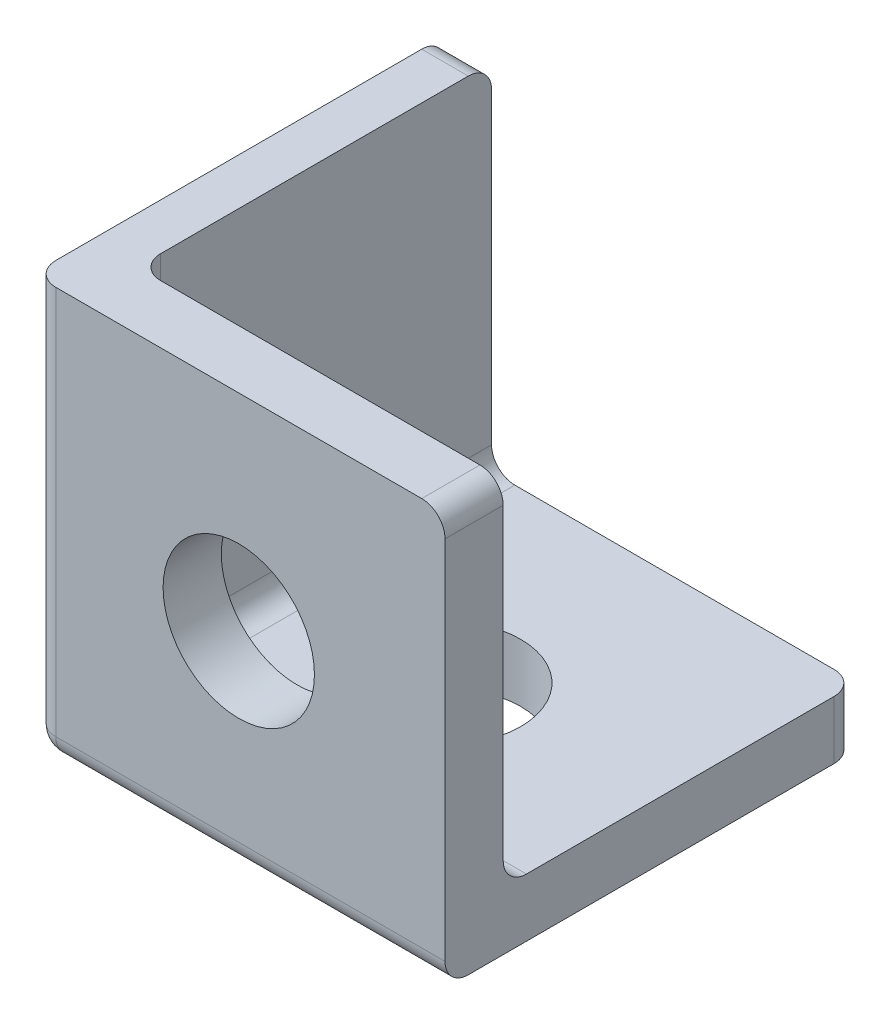
ISO-10303-21;
HEADER;
FILE_DESCRIPTION(('STEP AP214'),'2;1');
FILE_NAME('part.step','',(''),(''),'','','');
FILE_SCHEMA(('AUTOMOTIVE_DESIGN { 1 0 10303 214 1 1 1 1 }'));
ENDSEC;
DATA;
#1=APPLICATION_CONTEXT('core data for automotive mechanical design processes');
#2=APPLICATION_PROTOCOL_DEFINITION('international standard','automotive_design',2000,#1);
#3=PRODUCT_CONTEXT('',#1,'mechanical');
#4=PRODUCT('Part','Part','',(#3));
#5=PRODUCT_RELATED_PRODUCT_CATEGORY('part','',(#4));
#6=PRODUCT_DEFINITION_FORMATION('','',#4);
#7=PRODUCT_DEFINITION_CONTEXT('part definition',#1,'design');
#8=PRODUCT_DEFINITION('design','',#6,#7);
#9=PRODUCT_DEFINITION_SHAPE('','',#8);
#10=(LENGTH_UNIT() NAMED_UNIT(*) SI_UNIT(.MILLI.,.METRE.));
#11=(NAMED_UNIT(*) PLANE_ANGLE_UNIT() SI_UNIT($,.RADIAN.));
#12=(NAMED_UNIT(*) SI_UNIT($,.STERADIAN.) SOLID_ANGLE_UNIT());
#13=UNCERTAINTY_MEASURE_WITH_UNIT(LENGTH_MEASURE(1.E-05),#10,'distance_accuracy_value','');
#14=(GEOMETRIC_REPRESENTATION_CONTEXT(3) GLOBAL_UNCERTAINTY_ASSIGNED_CONTEXT((#13)) GLOBAL_UNIT_ASSIGNED_CONTEXT((#10,
#11,#12)) REPRESENTATION_CONTEXT('',''));
#15=CARTESIAN_POINT('',(0.,0.,0.));
#16=DIRECTION('',(0.,0.,1.));
#17=DIRECTION('',(1.,0.,0.));
#18=AXIS2_PLACEMENT_3D('',#15,#16,#17);
#19=CARTESIAN_POINT('',(45.,6.34999999999999,0.));
#20=DIRECTION('',(0.,-1.,0.));
#21=DIRECTION('',(0.,0.,-1.));
#22=AXIS2_PLACEMENT_3D('',#19,#20,#21);
#23=PLANE('',#22);
#24=CARTESIAN_POINT('',(22.5,6.35,-22.499999958));
#25=DIRECTION('',(0.,1.,0.));
#26=DIRECTION('',(0.,0.,1.));
#27=AXIS2_PLACEMENT_3D('',#24,#25,#26);
#28=CIRCLE('',#27,8.255);
#29=CARTESIAN_POINT('',(22.5,6.35,-14.244999958));
#30=VERTEX_POINT('',#29);
#31=EDGE_CURVE('E179',#30,#30,#28,.T.);
#32=ORIENTED_EDGE('',*,*,#31,.F.);
#33=EDGE_LOOP('',(#32));
#34=FACE_BOUND('',#33,.T.);
#35=DIRECTION('',(0.,0.,1.));
#36=VECTOR('',#35,1.);
#37=CARTESIAN_POINT('',(45.,6.34999999999999,0.));
#38=LINE('',#37,#36);
#39=CARTESIAN_POINT('',(45.,6.35,-42.459999916));
#40=VERTEX_POINT('',#39);
#41=CARTESIAN_POINT('',(45.,6.35,-8.89));
#42=VERTEX_POINT('',#41);
#43=EDGE_CURVE('E176',#40,#42,#38,.T.);
#44=ORIENTED_EDGE('',*,*,#43,.F.);
#45=CARTESIAN_POINT('',(42.46,6.35,-42.459999916));
#46=DIRECTION('',(0.,-1.,0.));
#47=DIRECTION('',(0.,0.,-1.));
#48=AXIS2_PLACEMENT_3D('',#45,#46,#47);
#49=CIRCLE('',#48,2.54);
#50=CARTESIAN_POINT('',(42.46,6.35,-44.999999916));
#51=VERTEX_POINT('',#50);
#52=EDGE_CURVE('E229',#40,#51,#49,.F.);
#53=ORIENTED_EDGE('',*,*,#52,.T.);
#54=DIRECTION('',(-1.,0.,0.));
#55=VECTOR('',#54,1.);
#56=CARTESIAN_POINT('',(45.,6.35,-44.999999916));
#57=LINE('',#56,#55);
#58=CARTESIAN_POINT('',(7.62000000000002,6.35,-44.999999916));
#59=VERTEX_POINT('',#58);
#60=EDGE_CURVE('E185',#51,#59,#57,.T.);
#61=ORIENTED_EDGE('',*,*,#60,.T.);
#62=DIRECTION('',(0.,0.,1.));
#63=VECTOR('',#62,1.);
#64=CARTESIAN_POINT('',(7.62,6.34999999999999,0.));
#65=LINE('',#64,#63);
#66=CARTESIAN_POINT('',(7.62,6.35,-8.89));
#67=VERTEX_POINT('',#66);
#68=EDGE_CURVE('E225',#59,#67,#65,.T.);
#69=ORIENTED_EDGE('',*,*,#68,.T.);
#70=DIRECTION('',(-1.,0.,0.));
#71=VECTOR('',#70,1.);
#72=CARTESIAN_POINT('',(45.,6.35,-8.89));
#73=LINE('',#72,#71);
#74=EDGE_CURVE('E227',#67,#42,#73,.F.);
#75=ORIENTED_EDGE('',*,*,#74,.T.);
#76=EDGE_LOOP('',(#44,#53,#61,#69,#75));
#77=FACE_BOUND('',#76,.T.);
#78=ADVANCED_FACE('F35',(#34,#77),#23,.F.);
#79=CARTESIAN_POINT('',(45.,0.,-6.35));
#80=DIRECTION('',(0.,0.,1.));
#81=DIRECTION('',(0.,-1.,0.));
#82=AXIS2_PLACEMENT_3D('',#79,#80,#81);
#83=PLANE('',#82);
#84=CARTESIAN_POINT('',(22.5,22.499999958,-6.35));
#85=DIRECTION('',(0.,0.,-1.));
#86=DIRECTION('',(0.,1.,0.));
#87=AXIS2_PLACEMENT_3D('',#84,#85,#86);
#88=CIRCLE('',#87,8.255);
#89=CARTESIAN_POINT('',(22.5,30.754999958,-6.35));
#90=VERTEX_POINT('',#89);
#91=EDGE_CURVE('E254',#90,#90,#88,.T.);
#92=ORIENTED_EDGE('',*,*,#91,.F.);
#93=EDGE_LOOP('',(#92));
#94=FACE_BOUND('',#93,.T.);
#95=DIRECTION('',(-1.,0.,0.));
#96=VECTOR('',#95,1.);
#97=CARTESIAN_POINT('',(45.,44.999999916,-6.35));
#98=LINE('',#97,#96);
#99=CARTESIAN_POINT('',(42.46,44.999999916,-6.35));
#100=VERTEX_POINT('',#99);
#101=CARTESIAN_POINT('',(7.62000000000002,44.999999916,-6.35));
#102=VERTEX_POINT('',#101);
#103=EDGE_CURVE('E193',#100,#102,#98,.T.);
#104=ORIENTED_EDGE('',*,*,#103,.F.);
#105=CARTESIAN_POINT('',(42.46,42.459999916,-6.35));
#106=DIRECTION('',(0.,0.,1.));
#107=DIRECTION('',(0.,-1.,0.));
#108=AXIS2_PLACEMENT_3D('',#105,#106,#107);
#109=CIRCLE('',#108,2.54);
#110=CARTESIAN_POINT('',(45.,42.459999916,-6.35));
#111=VERTEX_POINT('',#110);
#112=EDGE_CURVE('E236',#100,#111,#109,.F.);
#113=ORIENTED_EDGE('',*,*,#112,.T.);
#114=DIRECTION('',(0.,1.,0.));
#115=VECTOR('',#114,1.);
#116=CARTESIAN_POINT('',(45.,0.,-6.35));
#117=LINE('',#116,#115);
#118=CARTESIAN_POINT('',(45.,8.89,-6.35));
#119=VERTEX_POINT('',#118);
#120=EDGE_CURVE('E270',#119,#111,#117,.T.);
#121=ORIENTED_EDGE('',*,*,#120,.F.);
#122=DIRECTION('',(-1.,0.,0.));
#123=VECTOR('',#122,1.);
#124=CARTESIAN_POINT('',(5.08000000000002,8.89,-6.35));
#125=LINE('',#124,#123);
#126=CARTESIAN_POINT('',(7.62,8.89,-6.35));
#127=VERTEX_POINT('',#126);
#128=EDGE_CURVE('E233',#119,#127,#125,.T.);
#129=ORIENTED_EDGE('',*,*,#128,.T.);
#130=DIRECTION('',(0.,1.,0.));
#131=VECTOR('',#130,1.);
#132=CARTESIAN_POINT('',(7.62,0.,-6.35));
#133=LINE('',#132,#131);
#134=EDGE_CURVE('E231',#127,#102,#133,.T.);
#135=ORIENTED_EDGE('',*,*,#134,.T.);
#136=EDGE_LOOP('',(#104,#113,#121,#129,#135));
#137=FACE_BOUND('',#136,.T.);
#138=ADVANCED_FACE('F268',(#94,#137),#83,.F.);
#139=CARTESIAN_POINT('',(45.,44.999999916,0.));
#140=DIRECTION('',(0.,1.,0.));
#141=DIRECTION('',(0.,0.,1.));
#142=AXIS2_PLACEMENT_3D('',#139,#140,#141);
#143=PLANE('',#142);
#144=DIRECTION('',(0.,0.,-1.));
#145=VECTOR('',#144,1.);
#146=CARTESIAN_POINT('',(0.,44.999999916,0.));
#147=LINE('',#146,#145);
#148=CARTESIAN_POINT('',(0.,44.999999916,-2.54));
#149=VERTEX_POINT('',#148);
#150=CARTESIAN_POINT('',(0.,44.999999916,-42.459999916));
#151=VERTEX_POINT('',#150);
#152=EDGE_CURVE('E162',#149,#151,#147,.T.);
#153=ORIENTED_EDGE('',*,*,#152,.F.);
#154=CARTESIAN_POINT('',(2.54,44.999999916,-2.54));
#155=DIRECTION('',(0.,1.,0.));
#156=DIRECTION('',(0.,0.,1.));
#157=AXIS2_PLACEMENT_3D('',#154,#155,#156);
#158=CIRCLE('',#157,2.54);
#159=CARTESIAN_POINT('',(2.54000000000001,44.999999916,0.));
#160=VERTEX_POINT('',#159);
#161=EDGE_CURVE('E146',#149,#160,#158,.T.);
#162=ORIENTED_EDGE('',*,*,#161,.T.);
#163=DIRECTION('',(-1.,0.,0.));
#164=VECTOR('',#163,1.);
#165=CARTESIAN_POINT('',(45.,44.999999916,0.));
#166=LINE('',#165,#164);
#167=CARTESIAN_POINT('',(42.46,44.999999916,0.));
#168=VERTEX_POINT('',#167);
#169=EDGE_CURVE('E191',#168,#160,#166,.T.);
#170=ORIENTED_EDGE('',*,*,#169,.F.);
#171=DIRECTION('',(0.,0.,-1.));
#172=VECTOR('',#171,1.);
#173=CARTESIAN_POINT('',(42.46,44.999999916,0.));
#174=LINE('',#173,#172);
#175=EDGE_CURVE('E157',#168,#100,#174,.T.);
#176=ORIENTED_EDGE('',*,*,#175,.T.);
#177=ORIENTED_EDGE('',*,*,#103,.T.);
#178=CARTESIAN_POINT('',(7.62,44.999999916,-8.89));
#179=DIRECTION('',(0.,1.,0.));
#180=DIRECTION('',(0.,0.,1.));
#181=AXIS2_PLACEMENT_3D('',#178,#179,#180);
#182=CIRCLE('',#181,2.54);
#183=CARTESIAN_POINT('',(5.08,44.999999916,-8.89));
#184=VERTEX_POINT('',#183);
#185=EDGE_CURVE('E11',#102,#184,#182,.F.);
#186=ORIENTED_EDGE('',*,*,#185,.T.);
#187=DIRECTION('',(0.,0.,1.));
#188=VECTOR('',#187,1.);
#189=CARTESIAN_POINT('',(5.08,44.999999916,0.));
#190=LINE('',#189,#188);
#191=CARTESIAN_POINT('',(5.08,44.999999916,-42.459999916));
#192=VERTEX_POINT('',#191);
#193=EDGE_CURVE('E324',#192,#184,#190,.T.);
#194=ORIENTED_EDGE('',*,*,#193,.F.);
#195=DIRECTION('',(-1.,0.,0.));
#196=VECTOR('',#195,1.);
#197=CARTESIAN_POINT('',(45.,44.999999916,-42.459999916));
#198=LINE('',#197,#196);
#199=EDGE_CURVE('E167',#192,#151,#198,.T.);
#200=ORIENTED_EDGE('',*,*,#199,.T.);
#201=EDGE_LOOP('',(#153,#162,#170,#176,#177,#186,#194,#200));
#202=FACE_BOUND('',#201,.T.);
#203=ADVANCED_FACE('F170',(#202),#143,.T.);
#204=CARTESIAN_POINT('',(45.,0.,0.));
#205=DIRECTION('',(0.,0.,1.));
#206=DIRECTION('',(1.,0.,0.));
#207=AXIS2_PLACEMENT_3D('',#204,#205,#206);
#208=PLANE('',#207);
#209=CARTESIAN_POINT('',(22.5,22.499999958,0.));
#210=DIRECTION('',(0.,0.,-1.));
#211=DIRECTION('',(0.,1.,0.));
#212=AXIS2_PLACEMENT_3D('',#209,#210,#211);
#213=CIRCLE('',#212,8.255);
#214=CARTESIAN_POINT('',(22.5,30.754999958,0.));
#215=VERTEX_POINT('',#214);
#216=EDGE_CURVE('E325',#215,#215,#213,.T.);
#217=ORIENTED_EDGE('',*,*,#216,.T.);
#218=EDGE_LOOP('',(#217));
#219=FACE_BOUND('',#218,.T.);
#220=ORIENTED_EDGE('',*,*,#169,.T.);
#221=DIRECTION('',(0.,1.,0.));
#222=VECTOR('',#221,1.);
#223=CARTESIAN_POINT('',(2.54,0.,0.));
#224=LINE('',#223,#222);
#225=CARTESIAN_POINT('',(2.54,2.54,0.));
#226=VERTEX_POINT('',#225);
#227=EDGE_CURVE('E151',#160,#226,#224,.F.);
#228=ORIENTED_EDGE('',*,*,#227,.T.);
#229=DIRECTION('',(-1.,0.,0.));
#230=VECTOR('',#229,1.);
#231=CARTESIAN_POINT('',(45.,2.54,0.));
#232=LINE('',#231,#230);
#233=CARTESIAN_POINT('',(45.,2.54,0.));
#234=VERTEX_POINT('',#233);
#235=EDGE_CURVE('E203',#226,#234,#232,.F.);
#236=ORIENTED_EDGE('',*,*,#235,.T.);
#237=DIRECTION('',(0.,1.,0.));
#238=VECTOR('',#237,1.);
#239=CARTESIAN_POINT('',(45.,0.,0.));
#240=LINE('',#239,#238);
#241=CARTESIAN_POINT('',(45.,42.459999916,0.));
#242=VERTEX_POINT('',#241);
#243=EDGE_CURVE('E284',#234,#242,#240,.T.);
#244=ORIENTED_EDGE('',*,*,#243,.T.);
#245=CARTESIAN_POINT('',(42.46,42.459999916,0.));
#246=DIRECTION('',(0.,0.,1.));
#247=DIRECTION('',(1.,0.,0.));
#248=AXIS2_PLACEMENT_3D('',#245,#246,#247);
#249=CIRCLE('',#248,2.54);
#250=EDGE_CURVE('E156',#242,#168,#249,.T.);
#251=ORIENTED_EDGE('',*,*,#250,.T.);
#252=EDGE_LOOP('',(#220,#228,#236,#244,#251));
#253=FACE_BOUND('',#252,.T.);
#254=ADVANCED_FACE('F342',(#219,#253),#208,.T.);
#255=CARTESIAN_POINT('',(45.,0.,0.));
#256=DIRECTION('',(0.,-1.,0.));
#257=DIRECTION('',(0.,0.,-1.));
#258=AXIS2_PLACEMENT_3D('',#255,#256,#257);
#259=PLANE('',#258);
#260=CARTESIAN_POINT('',(22.5,0.,-22.499999958));
#261=DIRECTION('',(0.,1.,0.));
#262=DIRECTION('',(0.,0.,1.));
#263=AXIS2_PLACEMENT_3D('',#260,#261,#262);
#264=CIRCLE('',#263,8.255);
#265=CARTESIAN_POINT('',(22.5,0.,-14.244999958));
#266=VERTEX_POINT('',#265);
#267=EDGE_CURVE('E174',#266,#266,#264,.T.);
#268=ORIENTED_EDGE('',*,*,#267,.T.);
#269=EDGE_LOOP('',(#268));
#270=FACE_BOUND('',#269,.T.);
#271=DIRECTION('',(0.,0.,1.));
#272=VECTOR('',#271,1.);
#273=CARTESIAN_POINT('',(45.,0.,0.));
#274=LINE('',#273,#272);
#275=CARTESIAN_POINT('',(45.,0.,-42.459999916));
#276=VERTEX_POINT('',#275);
#277=CARTESIAN_POINT('',(45.,0.,-2.54));
#278=VERTEX_POINT('',#277);
#279=EDGE_CURVE('E182',#276,#278,#274,.T.);
#280=ORIENTED_EDGE('',*,*,#279,.T.);
#281=DIRECTION('',(-1.,0.,0.));
#282=VECTOR('',#281,1.);
#283=CARTESIAN_POINT('',(45.,0.,-2.54));
#284=LINE('',#283,#282);
#285=CARTESIAN_POINT('',(2.54,0.,-2.54));
#286=VERTEX_POINT('',#285);
#287=EDGE_CURVE('E210',#278,#286,#284,.T.);
#288=ORIENTED_EDGE('',*,*,#287,.T.);
#289=DIRECTION('',(0.,0.,1.));
#290=VECTOR('',#289,1.);
#291=CARTESIAN_POINT('',(2.54,0.,-44.999999916));
#292=LINE('',#291,#290);
#293=CARTESIAN_POINT('',(2.54000000000001,0.,-44.999999916));
#294=VERTEX_POINT('',#293);
#295=EDGE_CURVE('E208',#286,#294,#292,.F.);
#296=ORIENTED_EDGE('',*,*,#295,.T.);
#297=DIRECTION('',(-1.,0.,0.));
#298=VECTOR('',#297,1.);
#299=CARTESIAN_POINT('',(45.,0.,-44.999999916));
#300=LINE('',#299,#298);
#301=CARTESIAN_POINT('',(42.46,0.,-44.999999916));
#302=VERTEX_POINT('',#301);
#303=EDGE_CURVE('E188',#302,#294,#300,.T.);
#304=ORIENTED_EDGE('',*,*,#303,.F.);
#305=CARTESIAN_POINT('',(42.46,0.,-42.459999916));
#306=DIRECTION('',(0.,-1.,0.));
#307=DIRECTION('',(0.,0.,-1.));
#308=AXIS2_PLACEMENT_3D('',#305,#306,#307);
#309=CIRCLE('',#308,2.54);
#310=EDGE_CURVE('E206',#302,#276,#309,.T.);
#311=ORIENTED_EDGE('',*,*,#310,.T.);
#312=EDGE_LOOP('',(#280,#288,#296,#304,#311));
#313=FACE_BOUND('',#312,.T.);
#314=ADVANCED_FACE('F293',(#270,#313),#259,.T.);
#315=CARTESIAN_POINT('',(45.,0.,-44.999999916));
#316=DIRECTION('',(0.,0.,-1.));
#317=DIRECTION('',(-1.,0.,0.));
#318=AXIS2_PLACEMENT_3D('',#315,#316,#317);
#319=PLANE('',#318);
#320=ORIENTED_EDGE('',*,*,#303,.T.);
#321=CARTESIAN_POINT('',(2.54,2.54,-44.999999916));
#322=DIRECTION('',(0.,0.,-1.));
#323=DIRECTION('',(-1.,0.,0.));
#324=AXIS2_PLACEMENT_3D('',#321,#322,#323);
#325=CIRCLE('',#324,2.54);
#326=CARTESIAN_POINT('',(0.,2.54,-44.999999916));
#327=VERTEX_POINT('',#326);
#328=EDGE_CURVE('E223',#294,#327,#325,.T.);
#329=ORIENTED_EDGE('',*,*,#328,.T.);
#330=DIRECTION('',(0.,-1.,0.));
#331=VECTOR('',#330,1.);
#332=CARTESIAN_POINT('',(0.,0.,-44.999999916));
#333=LINE('',#332,#331);
#334=CARTESIAN_POINT('',(0.,42.459999916,-44.999999916));
#335=VERTEX_POINT('',#334);
#336=EDGE_CURVE('E173',#335,#327,#333,.T.);
#337=ORIENTED_EDGE('',*,*,#336,.F.);
#338=DIRECTION('',(-1.,0.,0.));
#339=VECTOR('',#338,1.);
#340=CARTESIAN_POINT('',(45.,42.459999916,-44.999999916));
#341=LINE('',#340,#339);
#342=CARTESIAN_POINT('',(5.08,42.459999916,-44.999999916));
#343=VERTEX_POINT('',#342);
#344=EDGE_CURVE('E218',#335,#343,#341,.F.);
#345=ORIENTED_EDGE('',*,*,#344,.T.);
#346=DIRECTION('',(0.,1.,0.));
#347=VECTOR('',#346,1.);
#348=CARTESIAN_POINT('',(5.08,0.,-44.999999916));
#349=LINE('',#348,#347);
#350=CARTESIAN_POINT('',(5.08,8.89,-44.999999916));
#351=VERTEX_POINT('',#350);
#352=EDGE_CURVE('E321',#351,#343,#349,.T.);
#353=ORIENTED_EDGE('',*,*,#352,.F.);
#354=CARTESIAN_POINT('',(7.62,8.89,-44.999999916));
#355=DIRECTION('',(0.,0.,-1.));
#356=DIRECTION('',(-1.,0.,0.));
#357=AXIS2_PLACEMENT_3D('',#354,#355,#356);
#358=CIRCLE('',#357,2.54);
#359=EDGE_CURVE('E44',#351,#59,#358,.F.);
#360=ORIENTED_EDGE('',*,*,#359,.T.);
#361=ORIENTED_EDGE('',*,*,#60,.F.);
#362=DIRECTION('',(0.,-1.,0.));
#363=VECTOR('',#362,1.);
#364=CARTESIAN_POINT('',(42.46,0.,-44.999999916));
#365=LINE('',#364,#363);
#366=EDGE_CURVE('E220',#51,#302,#365,.T.);
#367=ORIENTED_EDGE('',*,*,#366,.T.);
#368=EDGE_LOOP('',(#320,#329,#337,#345,#353,#360,#361,#367));
#369=FACE_BOUND('',#368,.T.);
#370=ADVANCED_FACE('F308',(#369),#319,.T.);
#371=CARTESIAN_POINT('',(45.,0.,0.));
#372=DIRECTION('',(1.,0.,0.));
#373=DIRECTION('',(0.,0.,-1.));
#374=AXIS2_PLACEMENT_3D('',#371,#372,#373);
#375=PLANE('',#374);
#376=ORIENTED_EDGE('',*,*,#243,.F.);
#377=CARTESIAN_POINT('',(45.,2.54,-2.54));
#378=DIRECTION('',(1.,0.,0.));
#379=DIRECTION('',(0.,0.,-1.));
#380=AXIS2_PLACEMENT_3D('',#377,#378,#379);
#381=CIRCLE('',#380,2.54);
#382=EDGE_CURVE('E216',#234,#278,#381,.T.);
#383=ORIENTED_EDGE('',*,*,#382,.T.);
#384=ORIENTED_EDGE('',*,*,#279,.F.);
#385=DIRECTION('',(0.,-1.,0.));
#386=VECTOR('',#385,1.);
#387=CARTESIAN_POINT('',(45.,0.,-42.459999916));
#388=LINE('',#387,#386);
#389=EDGE_CURVE('E214',#276,#40,#388,.F.);
#390=ORIENTED_EDGE('',*,*,#389,.T.);
#391=ORIENTED_EDGE('',*,*,#43,.T.);
#392=CARTESIAN_POINT('',(45.,8.89,-8.89));
#393=DIRECTION('',(1.,0.,0.));
#394=DIRECTION('',(0.,0.,-1.));
#395=AXIS2_PLACEMENT_3D('',#392,#393,#394);
#396=CIRCLE('',#395,2.54);
#397=EDGE_CURVE('E243',#42,#119,#396,.F.);
#398=ORIENTED_EDGE('',*,*,#397,.T.);
#399=ORIENTED_EDGE('',*,*,#120,.T.);
#400=DIRECTION('',(0.,0.,-1.));
#401=VECTOR('',#400,1.);
#402=CARTESIAN_POINT('',(45.,42.459999916,0.));
#403=LINE('',#402,#401);
#404=EDGE_CURVE('E212',#111,#242,#403,.F.);
#405=ORIENTED_EDGE('',*,*,#404,.T.);
#406=EDGE_LOOP('',(#376,#383,#384,#390,#391,#398,#399,#405));
#407=FACE_BOUND('',#406,.T.);
#408=ADVANCED_FACE('F276',(#407),#375,.T.);
#409=CARTESIAN_POINT('',(0.,0.,0.));
#410=DIRECTION('',(1.,0.,0.));
#411=DIRECTION('',(0.,0.,-1.));
#412=AXIS2_PLACEMENT_3D('',#409,#410,#411);
#413=PLANE('',#412);
#414=DIRECTION('',(0.,0.,1.));
#415=VECTOR('',#414,1.);
#416=CARTESIAN_POINT('',(0.,2.54,0.));
#417=LINE('',#416,#415);
#418=CARTESIAN_POINT('',(0.,2.54,-2.54));
#419=VERTEX_POINT('',#418);
#420=EDGE_CURVE('E165',#327,#419,#417,.T.);
#421=ORIENTED_EDGE('',*,*,#420,.T.);
#422=DIRECTION('',(0.,1.,0.));
#423=VECTOR('',#422,1.);
#424=CARTESIAN_POINT('',(0.,44.999999916,-2.54));
#425=LINE('',#424,#423);
#426=EDGE_CURVE('E150',#419,#149,#425,.T.);
#427=ORIENTED_EDGE('',*,*,#426,.T.);
#428=ORIENTED_EDGE('',*,*,#152,.T.);
#429=CARTESIAN_POINT('',(0.,42.459999916,-42.459999916));
#430=DIRECTION('',(1.,0.,0.));
#431=DIRECTION('',(0.,0.,-1.));
#432=AXIS2_PLACEMENT_3D('',#429,#430,#431);
#433=CIRCLE('',#432,2.54);
#434=EDGE_CURVE('E196',#151,#335,#433,.F.);
#435=ORIENTED_EDGE('',*,*,#434,.T.);
#436=ORIENTED_EDGE('',*,*,#336,.T.);
#437=EDGE_LOOP('',(#421,#427,#428,#435,#436));
#438=FACE_BOUND('',#437,.T.);
#439=ADVANCED_FACE('F161',(#438),#413,.F.);
#440=CARTESIAN_POINT('',(22.5,0.,-22.499999958));
#441=DIRECTION('',(0.,1.,0.));
#442=DIRECTION('',(0.,0.,1.));
#443=AXIS2_PLACEMENT_3D('',#440,#441,#442);
#444=CYLINDRICAL_SURFACE('',#443,8.255);
#445=ORIENTED_EDGE('',*,*,#267,.F.);
#446=EDGE_LOOP('',(#445));
#447=FACE_BOUND('',#446,.T.);
#448=ORIENTED_EDGE('',*,*,#31,.T.);
#449=EDGE_LOOP('',(#448));
#450=FACE_BOUND('',#449,.T.);
#451=ADVANCED_FACE('F447',(#447,#450),#444,.F.);
#452=CARTESIAN_POINT('',(5.08,0.,0.));
#453=DIRECTION('',(1.,0.,0.));
#454=DIRECTION('',(0.,0.,-1.));
#455=AXIS2_PLACEMENT_3D('',#452,#453,#454);
#456=PLANE('',#455);
#457=DIRECTION('',(0.,1.,0.));
#458=VECTOR('',#457,1.);
#459=CARTESIAN_POINT('',(5.08,0.,-8.89));
#460=LINE('',#459,#458);
#461=CARTESIAN_POINT('',(5.08,8.89,-8.89));
#462=VERTEX_POINT('',#461);
#463=EDGE_CURVE('E52',#184,#462,#460,.F.);
#464=ORIENTED_EDGE('',*,*,#463,.T.);
#465=DIRECTION('',(0.,0.,1.));
#466=VECTOR('',#465,1.);
#467=CARTESIAN_POINT('',(5.08,8.89,0.));
#468=LINE('',#467,#466);
#469=EDGE_CURVE('E241',#462,#351,#468,.F.);
#470=ORIENTED_EDGE('',*,*,#469,.T.);
#471=ORIENTED_EDGE('',*,*,#352,.T.);
#472=CARTESIAN_POINT('',(5.08,42.459999916,-42.459999916));
#473=DIRECTION('',(1.,0.,0.));
#474=DIRECTION('',(0.,0.,-1.));
#475=AXIS2_PLACEMENT_3D('',#472,#473,#474);
#476=CIRCLE('',#475,2.54);
#477=EDGE_CURVE('E238',#343,#192,#476,.T.);
#478=ORIENTED_EDGE('',*,*,#477,.T.);
#479=ORIENTED_EDGE('',*,*,#193,.T.);
#480=EDGE_LOOP('',(#464,#470,#471,#478,#479));
#481=FACE_BOUND('',#480,.T.);
#482=ADVANCED_FACE('F320',(#481),#456,.T.);
#483=CARTESIAN_POINT('',(22.5,22.499999958,0.));
#484=DIRECTION('',(0.,0.,-1.));
#485=DIRECTION('',(0.,1.,0.));
#486=AXIS2_PLACEMENT_3D('',#483,#484,#485);
#487=CYLINDRICAL_SURFACE('',#486,8.255);
#488=ORIENTED_EDGE('',*,*,#216,.F.);
#489=EDGE_LOOP('',(#488));
#490=FACE_BOUND('',#489,.T.);
#491=ORIENTED_EDGE('',*,*,#91,.T.);
#492=EDGE_LOOP('',(#491));
#493=FACE_BOUND('',#492,.T.);
#494=ADVANCED_FACE('F334',(#490,#493),#487,.F.);
#495=CARTESIAN_POINT('',(45.,2.54,-2.54));
#496=DIRECTION('',(-1.,0.,0.));
#497=DIRECTION('',(0.,0.,1.));
#498=AXIS2_PLACEMENT_3D('',#495,#496,#497);
#499=CYLINDRICAL_SURFACE('',#498,2.54);
#500=ORIENTED_EDGE('',*,*,#382,.F.);
#501=ORIENTED_EDGE('',*,*,#235,.F.);
#502=CARTESIAN_POINT('',(2.54,2.54,-2.54));
#503=DIRECTION('',(-1.,0.,0.));
#504=DIRECTION('',(0.,0.,1.));
#505=AXIS2_PLACEMENT_3D('',#502,#503,#504);
#506=CIRCLE('',#505,2.54);
#507=EDGE_CURVE('E251',#286,#226,#506,.T.);
#508=ORIENTED_EDGE('',*,*,#507,.F.);
#509=ORIENTED_EDGE('',*,*,#287,.F.);
#510=EDGE_LOOP('',(#500,#501,#508,#509));
#511=FACE_BOUND('',#510,.T.);
#512=ADVANCED_FACE('F299',(#511),#499,.T.);
#513=CARTESIAN_POINT('',(2.54,2.54,0.));
#514=DIRECTION('',(0.,0.,-1.));
#515=DIRECTION('',(0.,1.,0.));
#516=AXIS2_PLACEMENT_3D('',#513,#514,#515);
#517=CYLINDRICAL_SURFACE('',#516,2.54);
#518=ORIENTED_EDGE('',*,*,#328,.F.);
#519=ORIENTED_EDGE('',*,*,#295,.F.);
#520=CARTESIAN_POINT('',(2.54,2.54,-2.54));
#521=DIRECTION('',(0.,0.,1.));
#522=DIRECTION('',(0.,-1.,0.));
#523=AXIS2_PLACEMENT_3D('',#520,#521,#522);
#524=CIRCLE('',#523,2.54);
#525=EDGE_CURVE('E248',#419,#286,#524,.T.);
#526=ORIENTED_EDGE('',*,*,#525,.F.);
#527=ORIENTED_EDGE('',*,*,#420,.F.);
#528=EDGE_LOOP('',(#518,#519,#526,#527));
#529=FACE_BOUND('',#528,.T.);
#530=ADVANCED_FACE('F306',(#529),#517,.T.);
#531=CARTESIAN_POINT('',(2.54,2.54,-2.54));
#532=DIRECTION('',(0.,-1.,0.));
#533=DIRECTION('',(0.,0.,-1.));
#534=AXIS2_PLACEMENT_3D('',#531,#532,#533);
#535=SPHERICAL_SURFACE('',#534,2.54);
#536=ORIENTED_EDGE('',*,*,#525,.T.);
#537=ORIENTED_EDGE('',*,*,#507,.T.);
#538=CARTESIAN_POINT('',(2.54,2.54,-2.54));
#539=DIRECTION('',(0.,-1.,0.));
#540=DIRECTION('',(0.,0.,-1.));
#541=AXIS2_PLACEMENT_3D('',#538,#539,#540);
#542=CIRCLE('',#541,2.54);
#543=EDGE_CURVE('E246',#419,#226,#542,.F.);
#544=ORIENTED_EDGE('',*,*,#543,.F.);
#545=EDGE_LOOP('',(#536,#537,#544));
#546=FACE_BOUND('',#545,.T.);
#547=ADVANCED_FACE('F303',(#546),#535,.T.);
#548=CARTESIAN_POINT('',(2.54,0.,-2.54));
#549=DIRECTION('',(0.,-1.,0.));
#550=DIRECTION('',(0.,0.,-1.));
#551=AXIS2_PLACEMENT_3D('',#548,#549,#550);
#552=CYLINDRICAL_SURFACE('',#551,2.54);
#553=ORIENTED_EDGE('',*,*,#543,.T.);
#554=ORIENTED_EDGE('',*,*,#227,.F.);
#555=ORIENTED_EDGE('',*,*,#161,.F.);
#556=ORIENTED_EDGE('',*,*,#426,.F.);
#557=EDGE_LOOP('',(#553,#554,#555,#556));
#558=FACE_BOUND('',#557,.T.);
#559=ADVANCED_FACE('F149',(#558),#552,.T.);
#560=CARTESIAN_POINT('',(42.46,0.,-42.459999916));
#561=DIRECTION('',(0.,-1.,0.));
#562=DIRECTION('',(0.,0.,-1.));
#563=AXIS2_PLACEMENT_3D('',#560,#561,#562);
#564=CYLINDRICAL_SURFACE('',#563,2.54);
#565=ORIENTED_EDGE('',*,*,#52,.F.);
#566=ORIENTED_EDGE('',*,*,#389,.F.);
#567=ORIENTED_EDGE('',*,*,#310,.F.);
#568=ORIENTED_EDGE('',*,*,#366,.F.);
#569=EDGE_LOOP('',(#565,#566,#567,#568));
#570=FACE_BOUND('',#569,.T.);
#571=ADVANCED_FACE('F313',(#570),#564,.T.);
#572=CARTESIAN_POINT('',(42.46,42.459999916,0.));
#573=DIRECTION('',(0.,0.,-1.));
#574=DIRECTION('',(-1.,0.,0.));
#575=AXIS2_PLACEMENT_3D('',#572,#573,#574);
#576=CYLINDRICAL_SURFACE('',#575,2.54);
#577=ORIENTED_EDGE('',*,*,#250,.F.);
#578=ORIENTED_EDGE('',*,*,#404,.F.);
#579=ORIENTED_EDGE('',*,*,#112,.F.);
#580=ORIENTED_EDGE('',*,*,#175,.F.);
#581=EDGE_LOOP('',(#577,#578,#579,#580));
#582=FACE_BOUND('',#581,.T.);
#583=ADVANCED_FACE('F358',(#582),#576,.T.);
#584=CARTESIAN_POINT('',(7.62,0.,-8.89));
#585=DIRECTION('',(0.,1.,0.));
#586=DIRECTION('',(0.,0.,1.));
#587=AXIS2_PLACEMENT_3D('',#584,#585,#586);
#588=CYLINDRICAL_SURFACE('',#587,2.54);
#589=ORIENTED_EDGE('',*,*,#185,.F.);
#590=ORIENTED_EDGE('',*,*,#134,.F.);
#591=CARTESIAN_POINT('',(7.62,8.89,-8.89));
#592=DIRECTION('',(0.,1.,0.));
#593=DIRECTION('',(0.,0.,1.));
#594=AXIS2_PLACEMENT_3D('',#591,#592,#593);
#595=CIRCLE('',#594,2.54);
#596=EDGE_CURVE('E39',#462,#127,#595,.T.);
#597=ORIENTED_EDGE('',*,*,#596,.F.);
#598=ORIENTED_EDGE('',*,*,#463,.F.);
#599=EDGE_LOOP('',(#589,#590,#597,#598));
#600=FACE_BOUND('',#599,.T.);
#601=ADVANCED_FACE('F264',(#600),#588,.F.);
#602=CARTESIAN_POINT('',(7.62,8.89,0.));
#603=DIRECTION('',(0.,0.,1.));
#604=DIRECTION('',(0.,-1.,0.));
#605=AXIS2_PLACEMENT_3D('',#602,#603,#604);
#606=CYLINDRICAL_SURFACE('',#605,2.54);
#607=ORIENTED_EDGE('',*,*,#359,.F.);
#608=ORIENTED_EDGE('',*,*,#469,.F.);
#609=CARTESIAN_POINT('',(7.62,8.89,-8.89));
#610=DIRECTION('',(0.,0.,-1.));
#611=DIRECTION('',(-1.,0.,0.));
#612=AXIS2_PLACEMENT_3D('',#609,#610,#611);
#613=CIRCLE('',#612,2.54);
#614=EDGE_CURVE('E255',#67,#462,#613,.T.);
#615=ORIENTED_EDGE('',*,*,#614,.F.);
#616=ORIENTED_EDGE('',*,*,#68,.F.);
#617=EDGE_LOOP('',(#607,#608,#615,#616));
#618=FACE_BOUND('',#617,.T.);
#619=ADVANCED_FACE('F317',(#618),#606,.F.);
#620=CARTESIAN_POINT('',(7.62,8.89,-8.89));
#621=DIRECTION('',(-1.,0.,0.));
#622=DIRECTION('',(0.,0.,1.));
#623=AXIS2_PLACEMENT_3D('',#620,#621,#622);
#624=SPHERICAL_SURFACE('',#623,2.54);
#625=ORIENTED_EDGE('',*,*,#614,.T.);
#626=ORIENTED_EDGE('',*,*,#596,.T.);
#627=CARTESIAN_POINT('',(7.62,8.89,-8.89));
#628=DIRECTION('',(1.,0.,0.));
#629=DIRECTION('',(0.,0.,-1.));
#630=AXIS2_PLACEMENT_3D('',#627,#628,#629);
#631=CIRCLE('',#630,2.54);
#632=EDGE_CURVE('E60',#67,#127,#631,.F.);
#633=ORIENTED_EDGE('',*,*,#632,.F.);
#634=EDGE_LOOP('',(#625,#626,#633));
#635=FACE_BOUND('',#634,.T.);
#636=ADVANCED_FACE('F261',(#635),#624,.F.);
#637=CARTESIAN_POINT('',(45.,8.89,-8.89));
#638=DIRECTION('',(1.,0.,0.));
#639=DIRECTION('',(0.,0.,-1.));
#640=AXIS2_PLACEMENT_3D('',#637,#638,#639);
#641=CYLINDRICAL_SURFACE('',#640,2.54);
#642=ORIENTED_EDGE('',*,*,#397,.F.);
#643=ORIENTED_EDGE('',*,*,#74,.F.);
#644=ORIENTED_EDGE('',*,*,#632,.T.);
#645=ORIENTED_EDGE('',*,*,#128,.F.);
#646=EDGE_LOOP('',(#642,#643,#644,#645));
#647=FACE_BOUND('',#646,.T.);
#648=ADVANCED_FACE('F272',(#647),#641,.F.);
#649=CARTESIAN_POINT('',(45.,42.459999916,-42.459999916));
#650=DIRECTION('',(-1.,0.,0.));
#651=DIRECTION('',(0.,0.,1.));
#652=AXIS2_PLACEMENT_3D('',#649,#650,#651);
#653=CYLINDRICAL_SURFACE('',#652,2.54);
#654=ORIENTED_EDGE('',*,*,#477,.F.);
#655=ORIENTED_EDGE('',*,*,#344,.F.);
#656=ORIENTED_EDGE('',*,*,#434,.F.);
#657=ORIENTED_EDGE('',*,*,#199,.F.);
#658=EDGE_LOOP('',(#654,#655,#656,#657));
#659=FACE_BOUND('',#658,.T.);
#660=ADVANCED_FACE('F37',(#659),#653,.T.);
#661=CLOSED_SHELL('',(#78,#138,#203,#254,#314,#370,#408,#439,#451,#482,#494,#512,#530,#547,#559,
#571,#583,#601,#619,#636,#648,#660));
#662=MANIFOLD_SOLID_BREP('B2',#661);
#663=ADVANCED_BREP_SHAPE_REPRESENTATION('',(#18,#662),#14);
#664=SHAPE_DEFINITION_REPRESENTATION(#9,#663);
ENDSEC;
END-ISO-10303-21;
